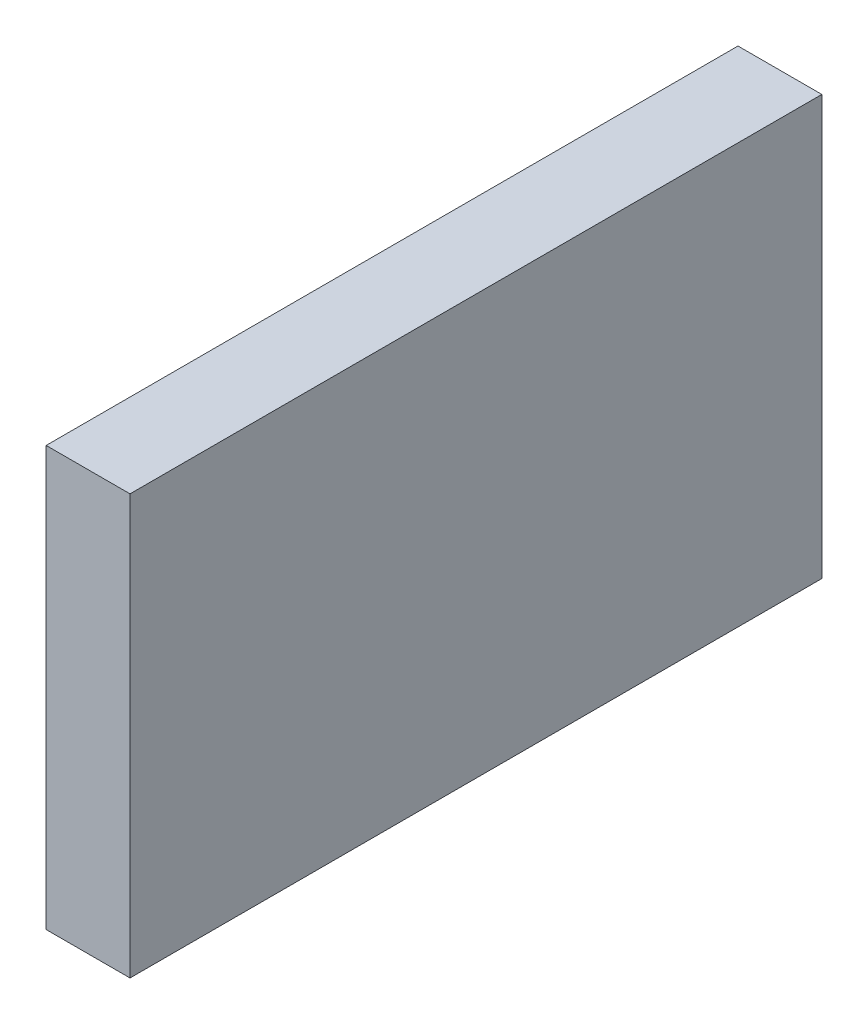
ISO-10303-21;
HEADER;
FILE_DESCRIPTION(('STEP AP214'),'2;1');
FILE_NAME('part.step','',(''),(''),'','','');
FILE_SCHEMA(('AUTOMOTIVE_DESIGN { 1 0 10303 214 1 1 1 1 }'));
ENDSEC;
DATA;
#1=APPLICATION_CONTEXT('core data for automotive mechanical design processes');
#2=APPLICATION_PROTOCOL_DEFINITION('international standard','automotive_design',2000,#1);
#3=PRODUCT_CONTEXT('',#1,'mechanical');
#4=PRODUCT('Part','Part','',(#3));
#5=PRODUCT_RELATED_PRODUCT_CATEGORY('part','',(#4));
#6=PRODUCT_DEFINITION_FORMATION('','',#4);
#7=PRODUCT_DEFINITION_CONTEXT('part definition',#1,'design');
#8=PRODUCT_DEFINITION('design','',#6,#7);
#9=PRODUCT_DEFINITION_SHAPE('','',#8);
#10=(LENGTH_UNIT() NAMED_UNIT(*) SI_UNIT(.MILLI.,.METRE.));
#11=(NAMED_UNIT(*) PLANE_ANGLE_UNIT() SI_UNIT($,.RADIAN.));
#12=(NAMED_UNIT(*) SI_UNIT($,.STERADIAN.) SOLID_ANGLE_UNIT());
#13=UNCERTAINTY_MEASURE_WITH_UNIT(LENGTH_MEASURE(1.E-05),#10,'distance_accuracy_value','');
#14=(GEOMETRIC_REPRESENTATION_CONTEXT(3) GLOBAL_UNCERTAINTY_ASSIGNED_CONTEXT((#13)) GLOBAL_UNIT_ASSIGNED_CONTEXT((#10,
#11,#12)) REPRESENTATION_CONTEXT('',''));
#15=CARTESIAN_POINT('',(0.,0.,0.));
#16=DIRECTION('',(0.,0.,1.));
#17=DIRECTION('',(1.,0.,0.));
#18=AXIS2_PLACEMENT_3D('',#15,#16,#17);
#19=CARTESIAN_POINT('',(4.,-10.,-16.5));
#20=DIRECTION('',(0.,0.,1.));
#21=DIRECTION('',(1.,0.,0.));
#22=AXIS2_PLACEMENT_3D('',#19,#20,#21);
#23=PLANE('',#22);
#24=DIRECTION('',(0.,1.,0.));
#25=VECTOR('',#24,1.);
#26=CARTESIAN_POINT('',(0.,-10.,-16.5));
#27=LINE('',#26,#25);
#28=CARTESIAN_POINT('',(0.,-10.,-16.5));
#29=VERTEX_POINT('',#28);
#30=CARTESIAN_POINT('',(0.,10.,-16.5));
#31=VERTEX_POINT('',#30);
#32=EDGE_CURVE('E96',#29,#31,#27,.T.);
#33=ORIENTED_EDGE('',*,*,#32,.T.);
#34=DIRECTION('',(-1.,0.,0.));
#35=VECTOR('',#34,1.);
#36=CARTESIAN_POINT('',(4.,10.,-16.5));
#37=LINE('',#36,#35);
#38=CARTESIAN_POINT('',(4.,10.,-16.5));
#39=VERTEX_POINT('',#38);
#40=EDGE_CURVE('E11',#39,#31,#37,.T.);
#41=ORIENTED_EDGE('',*,*,#40,.F.);
#42=DIRECTION('',(0.,1.,0.));
#43=VECTOR('',#42,1.);
#44=CARTESIAN_POINT('',(4.,-10.,-16.5));
#45=LINE('',#44,#43);
#46=CARTESIAN_POINT('',(4.,-10.,-16.5));
#47=VERTEX_POINT('',#46);
#48=EDGE_CURVE('E84',#47,#39,#45,.T.);
#49=ORIENTED_EDGE('',*,*,#48,.F.);
#50=DIRECTION('',(-1.,0.,0.));
#51=VECTOR('',#50,1.);
#52=CARTESIAN_POINT('',(4.,-10.,-16.5));
#53=LINE('',#52,#51);
#54=EDGE_CURVE('E92',#47,#29,#53,.T.);
#55=ORIENTED_EDGE('',*,*,#54,.T.);
#56=EDGE_LOOP('',(#33,#41,#49,#55));
#57=FACE_BOUND('',#56,.T.);
#58=ADVANCED_FACE('F33',(#57),#23,.F.);
#59=CARTESIAN_POINT('',(4.,10.,16.5));
#60=DIRECTION('',(0.,-1.,0.));
#61=DIRECTION('',(0.,0.,-1.));
#62=AXIS2_PLACEMENT_3D('',#59,#60,#61);
#63=PLANE('',#62);
#64=DIRECTION('',(0.,0.,1.));
#65=VECTOR('',#64,1.);
#66=CARTESIAN_POINT('',(0.,10.,16.5));
#67=LINE('',#66,#65);
#68=CARTESIAN_POINT('',(0.,10.,16.5));
#69=VERTEX_POINT('',#68);
#70=EDGE_CURVE('E88',#31,#69,#67,.T.);
#71=ORIENTED_EDGE('',*,*,#70,.T.);
#72=DIRECTION('',(-1.,0.,0.));
#73=VECTOR('',#72,1.);
#74=CARTESIAN_POINT('',(4.,10.,16.5));
#75=LINE('',#74,#73);
#76=CARTESIAN_POINT('',(4.,10.,16.5));
#77=VERTEX_POINT('',#76);
#78=EDGE_CURVE('E41',#77,#69,#75,.T.);
#79=ORIENTED_EDGE('',*,*,#78,.F.);
#80=DIRECTION('',(0.,0.,1.));
#81=VECTOR('',#80,1.);
#82=CARTESIAN_POINT('',(4.,10.,16.5));
#83=LINE('',#82,#81);
#84=EDGE_CURVE('E79',#39,#77,#83,.T.);
#85=ORIENTED_EDGE('',*,*,#84,.F.);
#86=ORIENTED_EDGE('',*,*,#40,.T.);
#87=EDGE_LOOP('',(#71,#79,#85,#86));
#88=FACE_BOUND('',#87,.T.);
#89=ADVANCED_FACE('F87',(#88),#63,.F.);
#90=CARTESIAN_POINT('',(4.,-10.,16.5));
#91=DIRECTION('',(0.,0.,-1.));
#92=DIRECTION('',(-1.,0.,0.));
#93=AXIS2_PLACEMENT_3D('',#90,#91,#92);
#94=PLANE('',#93);
#95=DIRECTION('',(0.,-1.,0.));
#96=VECTOR('',#95,1.);
#97=CARTESIAN_POINT('',(0.,-10.,16.5));
#98=LINE('',#97,#96);
#99=CARTESIAN_POINT('',(0.,-10.,16.5));
#100=VERTEX_POINT('',#99);
#101=EDGE_CURVE('E66',#69,#100,#98,.T.);
#102=ORIENTED_EDGE('',*,*,#101,.T.);
#103=DIRECTION('',(-1.,0.,0.));
#104=VECTOR('',#103,1.);
#105=CARTESIAN_POINT('',(4.,-10.,16.5));
#106=LINE('',#105,#104);
#107=CARTESIAN_POINT('',(4.,-10.,16.5));
#108=VERTEX_POINT('',#107);
#109=EDGE_CURVE('E89',#108,#100,#106,.T.);
#110=ORIENTED_EDGE('',*,*,#109,.F.);
#111=DIRECTION('',(0.,-1.,0.));
#112=VECTOR('',#111,1.);
#113=CARTESIAN_POINT('',(4.,-10.,16.5));
#114=LINE('',#113,#112);
#115=EDGE_CURVE('E82',#77,#108,#114,.T.);
#116=ORIENTED_EDGE('',*,*,#115,.F.);
#117=ORIENTED_EDGE('',*,*,#78,.T.);
#118=EDGE_LOOP('',(#102,#110,#116,#117));
#119=FACE_BOUND('',#118,.T.);
#120=ADVANCED_FACE('F90',(#119),#94,.F.);
#121=CARTESIAN_POINT('',(4.,-10.,16.5));
#122=DIRECTION('',(0.,1.,0.));
#123=DIRECTION('',(0.,0.,1.));
#124=AXIS2_PLACEMENT_3D('',#121,#122,#123);
#125=PLANE('',#124);
#126=DIRECTION('',(0.,0.,-1.));
#127=VECTOR('',#126,1.);
#128=CARTESIAN_POINT('',(0.,-10.,16.5));
#129=LINE('',#128,#127);
#130=EDGE_CURVE('E72',#100,#29,#129,.T.);
#131=ORIENTED_EDGE('',*,*,#130,.T.);
#132=ORIENTED_EDGE('',*,*,#54,.F.);
#133=DIRECTION('',(0.,0.,-1.));
#134=VECTOR('',#133,1.);
#135=CARTESIAN_POINT('',(4.,-10.,16.5));
#136=LINE('',#135,#134);
#137=EDGE_CURVE('E49',#108,#47,#136,.T.);
#138=ORIENTED_EDGE('',*,*,#137,.F.);
#139=ORIENTED_EDGE('',*,*,#109,.T.);
#140=EDGE_LOOP('',(#131,#132,#138,#139));
#141=FACE_BOUND('',#140,.T.);
#142=ADVANCED_FACE('F103',(#141),#125,.F.);
#143=CARTESIAN_POINT('',(4.,0.,0.));
#144=DIRECTION('',(-1.,0.,0.));
#145=DIRECTION('',(0.,0.,1.));
#146=AXIS2_PLACEMENT_3D('',#143,#144,#145);
#147=PLANE('',#146);
#148=ORIENTED_EDGE('',*,*,#48,.T.);
#149=ORIENTED_EDGE('',*,*,#84,.T.);
#150=ORIENTED_EDGE('',*,*,#115,.T.);
#151=ORIENTED_EDGE('',*,*,#137,.T.);
#152=EDGE_LOOP('',(#148,#149,#150,#151));
#153=FACE_BOUND('',#152,.T.);
#154=ADVANCED_FACE('F80',(#153),#147,.F.);
#155=CARTESIAN_POINT('',(0.,0.,0.));
#156=DIRECTION('',(-1.,0.,0.));
#157=DIRECTION('',(0.,0.,1.));
#158=AXIS2_PLACEMENT_3D('',#155,#156,#157);
#159=PLANE('',#158);
#160=ORIENTED_EDGE('',*,*,#32,.F.);
#161=ORIENTED_EDGE('',*,*,#130,.F.);
#162=ORIENTED_EDGE('',*,*,#101,.F.);
#163=ORIENTED_EDGE('',*,*,#70,.F.);
#164=EDGE_LOOP('',(#160,#161,#162,#163));
#165=FACE_BOUND('',#164,.T.);
#166=ADVANCED_FACE('F106',(#165),#159,.T.);
#167=CLOSED_SHELL('',(#58,#89,#120,#142,#154,#166));
#168=MANIFOLD_SOLID_BREP('B2',#167);
#169=ADVANCED_BREP_SHAPE_REPRESENTATION('',(#18,#168),#14);
#170=SHAPE_DEFINITION_REPRESENTATION(#9,#169);
ENDSEC;
END-ISO-10303-21;
